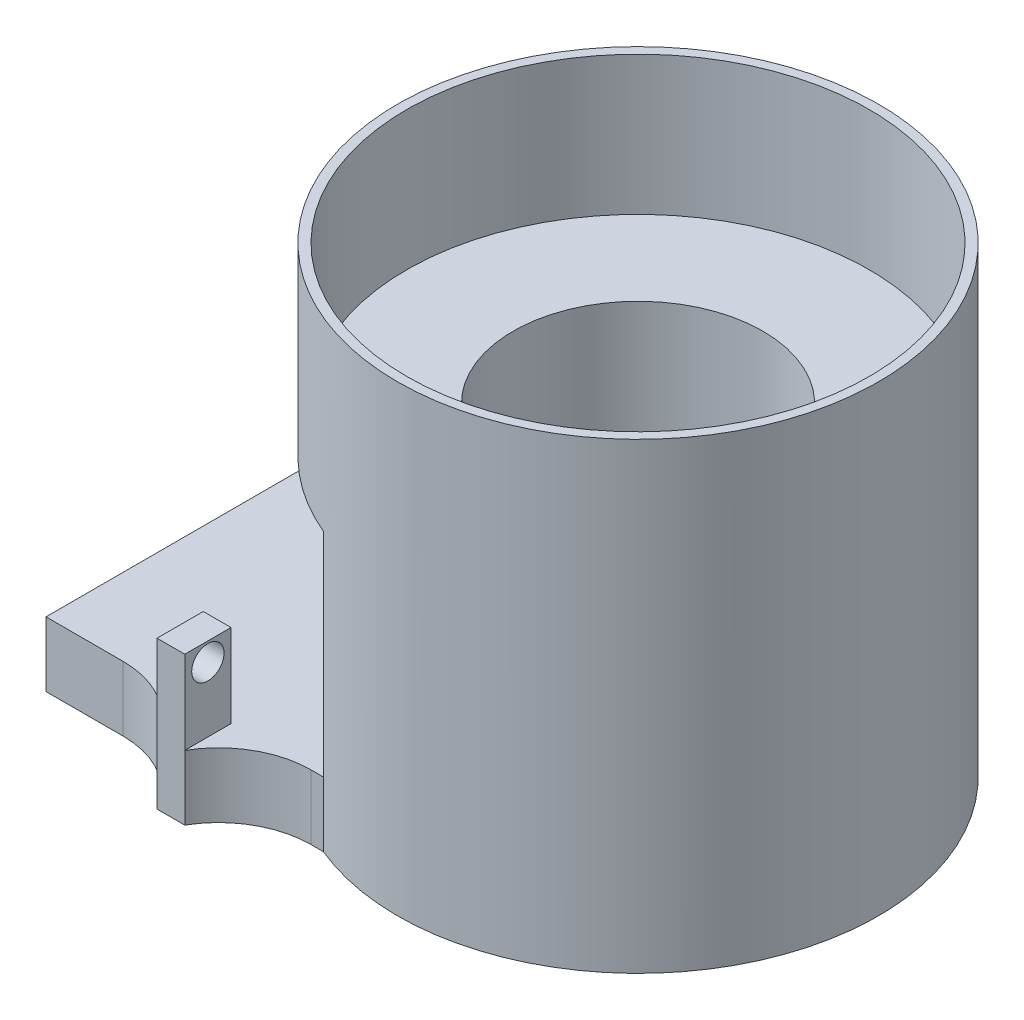
ISO-10303-21;
HEADER;
FILE_DESCRIPTION(('STEP AP214'),'2;1');
FILE_NAME('part.step','',(''),(''),'','','');
FILE_SCHEMA(('AUTOMOTIVE_DESIGN { 1 0 10303 214 1 1 1 1 }'));
ENDSEC;
DATA;
#1=APPLICATION_CONTEXT('core data for automotive mechanical design processes');
#2=APPLICATION_PROTOCOL_DEFINITION('international standard','automotive_design',2000,#1);
#3=PRODUCT_CONTEXT('',#1,'mechanical');
#4=PRODUCT('Part','Part','',(#3));
#5=PRODUCT_RELATED_PRODUCT_CATEGORY('part','',(#4));
#6=PRODUCT_DEFINITION_FORMATION('','',#4);
#7=PRODUCT_DEFINITION_CONTEXT('part definition',#1,'design');
#8=PRODUCT_DEFINITION('design','',#6,#7);
#9=PRODUCT_DEFINITION_SHAPE('','',#8);
#10=(LENGTH_UNIT() NAMED_UNIT(*) SI_UNIT(.MILLI.,.METRE.));
#11=(NAMED_UNIT(*) PLANE_ANGLE_UNIT() SI_UNIT($,.RADIAN.));
#12=(NAMED_UNIT(*) SI_UNIT($,.STERADIAN.) SOLID_ANGLE_UNIT());
#13=UNCERTAINTY_MEASURE_WITH_UNIT(LENGTH_MEASURE(1.E-05),#10,'distance_accuracy_value','');
#14=(GEOMETRIC_REPRESENTATION_CONTEXT(3) GLOBAL_UNCERTAINTY_ASSIGNED_CONTEXT((#13)) GLOBAL_UNIT_ASSIGNED_CONTEXT((#10,
#11,#12)) REPRESENTATION_CONTEXT('',''));
#15=CARTESIAN_POINT('',(0.,0.,0.));
#16=DIRECTION('',(0.,0.,1.));
#17=DIRECTION('',(1.,0.,0.));
#18=AXIS2_PLACEMENT_3D('',#15,#16,#17);
#19=CARTESIAN_POINT('',(0.,2.,0.));
#20=DIRECTION('',(0.,1.,0.));
#21=DIRECTION('',(0.,0.,1.));
#22=AXIS2_PLACEMENT_3D('',#19,#20,#21);
#23=PLANE('',#22);
#24=CARTESIAN_POINT('',(0.,2.,0.));
#25=DIRECTION('',(0.,1.,0.));
#26=DIRECTION('',(0.,0.,1.));
#27=AXIS2_PLACEMENT_3D('',#24,#25,#26);
#28=CIRCLE('',#27,21.5);
#29=CARTESIAN_POINT('',(0.,2.,21.5));
#30=VERTEX_POINT('',#29);
#31=EDGE_CURVE('E545',#30,#30,#28,.T.);
#32=ORIENTED_EDGE('',*,*,#31,.F.);
#33=EDGE_LOOP('',(#32));
#34=FACE_BOUND('',#33,.T.);
#35=CARTESIAN_POINT('',(0.,2.,0.));
#36=DIRECTION('',(0.,1.,0.));
#37=DIRECTION('',(0.,0.,1.));
#38=AXIS2_PLACEMENT_3D('',#35,#36,#37);
#39=CIRCLE('',#38,15.5);
#40=CARTESIAN_POINT('',(0.,2.,15.5));
#41=VERTEX_POINT('',#40);
#42=EDGE_CURVE('E47',#41,#41,#39,.F.);
#43=ORIENTED_EDGE('',*,*,#42,.F.);
#44=EDGE_LOOP('',(#43));
#45=FACE_BOUND('',#44,.T.);
#46=ADVANCED_FACE('F39',(#34,#45),#23,.F.);
#47=CARTESIAN_POINT('',(0.,5.,0.));
#48=DIRECTION('',(0.,-1.,0.));
#49=DIRECTION('',(0.,0.,-1.));
#50=AXIS2_PLACEMENT_3D('',#47,#48,#49);
#51=CYLINDRICAL_SURFACE('',#50,21.5);
#52=CARTESIAN_POINT('',(0.,0.,0.));
#53=DIRECTION('',(0.,1.,0.));
#54=DIRECTION('',(0.,0.,1.));
#55=AXIS2_PLACEMENT_3D('',#52,#53,#54);
#56=CIRCLE('',#55,21.5);
#57=CARTESIAN_POINT('',(-19.0328663106743,0.,-9.99999999999999));
#58=VERTEX_POINT('',#57);
#59=CARTESIAN_POINT('',(-10.,0.,19.0328663106743));
#60=VERTEX_POINT('',#59);
#61=EDGE_CURVE('E320',#58,#60,#56,.T.);
#62=ORIENTED_EDGE('',*,*,#61,.F.);
#63=DIRECTION('',(0.,-1.,0.));
#64=VECTOR('',#63,1.);
#65=CARTESIAN_POINT('',(-19.0328663106743,500000.,-9.99999999999999));
#66=LINE('',#65,#64);
#67=CARTESIAN_POINT('',(-19.0328663106743,-30.,-9.99999999999999));
#68=VERTEX_POINT('',#67);
#69=EDGE_CURVE('E312',#58,#68,#66,.T.);
#70=ORIENTED_EDGE('',*,*,#69,.T.);
#71=CARTESIAN_POINT('',(0.,-30.,0.));
#72=DIRECTION('',(0.,1.,0.));
#73=DIRECTION('',(0.,0.,-1.));
#74=AXIS2_PLACEMENT_3D('',#71,#72,#73);
#75=CIRCLE('',#74,21.5);
#76=CARTESIAN_POINT('',(-10.,-30.,19.0328663106743));
#77=VERTEX_POINT('',#76);
#78=EDGE_CURVE('E295',#77,#68,#75,.T.);
#79=ORIENTED_EDGE('',*,*,#78,.F.);
#80=DIRECTION('',(0.,-1.,0.));
#81=VECTOR('',#80,1.);
#82=CARTESIAN_POINT('',(-10.,5.,19.0328663106743));
#83=LINE('',#82,#81);
#84=CARTESIAN_POINT('',(-10.,-23.,19.0328663106743));
#85=VERTEX_POINT('',#84);
#86=EDGE_CURVE('E283',#85,#77,#83,.T.);
#87=ORIENTED_EDGE('',*,*,#86,.F.);
#88=DIRECTION('',(0.,-1.,0.));
#89=VECTOR('',#88,1.);
#90=CARTESIAN_POINT('',(-10.,500000.,19.0328663106743));
#91=LINE('',#90,#89);
#92=EDGE_CURVE('E309',#60,#85,#91,.T.);
#93=ORIENTED_EDGE('',*,*,#92,.F.);
#94=EDGE_LOOP('',(#62,#70,#79,#87,#93));
#95=FACE_BOUND('',#94,.T.);
#96=ORIENTED_EDGE('',*,*,#31,.T.);
#97=EDGE_LOOP('',(#96));
#98=FACE_BOUND('',#97,.T.);
#99=ADVANCED_FACE('F335',(#95,#98),#51,.F.);
#100=CARTESIAN_POINT('',(0.,0.,0.));
#101=DIRECTION('',(0.,1.,0.));
#102=DIRECTION('',(0.,0.,1.));
#103=AXIS2_PLACEMENT_3D('',#100,#101,#102);
#104=PLANE('',#103);
#105=CARTESIAN_POINT('',(0.,0.,0.));
#106=DIRECTION('',(0.,1.,0.));
#107=DIRECTION('',(0.,0.,1.));
#108=AXIS2_PLACEMENT_3D('',#105,#106,#107);
#109=CIRCLE('',#108,26.);
#110=CARTESIAN_POINT('',(-24.,0.,-9.99999999999999));
#111=VERTEX_POINT('',#110);
#112=CARTESIAN_POINT('',(-10.,0.,24.));
#113=VERTEX_POINT('',#112);
#114=EDGE_CURVE('E322',#111,#113,#109,.T.);
#115=ORIENTED_EDGE('',*,*,#114,.F.);
#116=DIRECTION('',(-1.,0.,0.));
#117=VECTOR('',#116,1.);
#118=CARTESIAN_POINT('',(-20.,0.,-9.99999999999999));
#119=LINE('',#118,#117);
#120=EDGE_CURVE('E289',#58,#111,#119,.T.);
#121=ORIENTED_EDGE('',*,*,#120,.F.);
#122=ORIENTED_EDGE('',*,*,#61,.T.);
#123=DIRECTION('',(0.,0.,-1.));
#124=VECTOR('',#123,1.);
#125=CARTESIAN_POINT('',(-10.,0.,19.0328663106743));
#126=LINE('',#125,#124);
#127=EDGE_CURVE('E286',#113,#60,#126,.T.);
#128=ORIENTED_EDGE('',*,*,#127,.F.);
#129=EDGE_LOOP('',(#115,#121,#122,#128));
#130=FACE_BOUND('',#129,.T.);
#131=ADVANCED_FACE('F341',(#130),#104,.F.);
#132=CARTESIAN_POINT('',(0.,5.,0.));
#133=DIRECTION('',(0.,1.,0.));
#134=DIRECTION('',(0.,0.,1.));
#135=AXIS2_PLACEMENT_3D('',#132,#133,#134);
#136=PLANE('',#135);
#137=CARTESIAN_POINT('',(0.,5.,0.));
#138=DIRECTION('',(0.,1.,0.));
#139=DIRECTION('',(0.,0.,1.));
#140=AXIS2_PLACEMENT_3D('',#137,#138,#139);
#141=CIRCLE('',#140,25.);
#142=CARTESIAN_POINT('',(0.,5.,25.));
#143=VERTEX_POINT('',#142);
#144=EDGE_CURVE('E324',#143,#143,#141,.F.);
#145=ORIENTED_EDGE('',*,*,#144,.F.);
#146=EDGE_LOOP('',(#145));
#147=FACE_BOUND('',#146,.T.);
#148=CARTESIAN_POINT('',(0.,5.,0.));
#149=DIRECTION('',(0.,1.,0.));
#150=DIRECTION('',(0.,0.,1.));
#151=AXIS2_PLACEMENT_3D('',#148,#149,#150);
#152=CIRCLE('',#151,13.5);
#153=CARTESIAN_POINT('',(0.,5.,13.5));
#154=VERTEX_POINT('',#153);
#155=EDGE_CURVE('E548',#154,#154,#152,.T.);
#156=ORIENTED_EDGE('',*,*,#155,.F.);
#157=EDGE_LOOP('',(#156));
#158=FACE_BOUND('',#157,.T.);
#159=ADVANCED_FACE('F439',(#147,#158),#136,.T.);
#160=CARTESIAN_POINT('',(0.,5.,0.));
#161=DIRECTION('',(0.,-1.,0.));
#162=DIRECTION('',(0.,0.,-1.));
#163=AXIS2_PLACEMENT_3D('',#160,#161,#162);
#164=CYLINDRICAL_SURFACE('',#163,26.);
#165=ORIENTED_EDGE('',*,*,#114,.T.);
#166=DIRECTION('',(0.,-1.,0.));
#167=VECTOR('',#166,1.);
#168=CARTESIAN_POINT('',(-10.,500000.,24.));
#169=LINE('',#168,#167);
#170=CARTESIAN_POINT('',(-10.,-23.,24.));
#171=VERTEX_POINT('',#170);
#172=EDGE_CURVE('E291',#113,#171,#169,.T.);
#173=ORIENTED_EDGE('',*,*,#172,.T.);
#174=DIRECTION('',(0.,-1.,0.));
#175=VECTOR('',#174,1.);
#176=CARTESIAN_POINT('',(-10.,-23.,24.));
#177=LINE('',#176,#175);
#178=CARTESIAN_POINT('',(-10.,-30.,24.));
#179=VERTEX_POINT('',#178);
#180=EDGE_CURVE('E221',#171,#179,#177,.T.);
#181=ORIENTED_EDGE('',*,*,#180,.T.);
#182=CARTESIAN_POINT('',(0.,-30.,0.));
#183=DIRECTION('',(0.,-1.,0.));
#184=DIRECTION('',(0.,0.,-1.));
#185=AXIS2_PLACEMENT_3D('',#182,#183,#184);
#186=CIRCLE('',#185,26.);
#187=CARTESIAN_POINT('',(-24.,-30.,-9.99999999999999));
#188=VERTEX_POINT('',#187);
#189=EDGE_CURVE('E300',#188,#179,#186,.T.);
#190=ORIENTED_EDGE('',*,*,#189,.F.);
#191=DIRECTION('',(0.,-1.,0.));
#192=VECTOR('',#191,1.);
#193=CARTESIAN_POINT('',(-24.,500000.,-9.99999999999999));
#194=LINE('',#193,#192);
#195=EDGE_CURVE('E303',#111,#188,#194,.T.);
#196=ORIENTED_EDGE('',*,*,#195,.F.);
#197=EDGE_LOOP('',(#165,#173,#181,#190,#196));
#198=FACE_BOUND('',#197,.T.);
#199=CARTESIAN_POINT('',(0.,20.,0.));
#200=DIRECTION('',(0.,1.,0.));
#201=DIRECTION('',(0.,0.,1.));
#202=AXIS2_PLACEMENT_3D('',#199,#200,#201);
#203=CIRCLE('',#202,26.);
#204=CARTESIAN_POINT('',(0.,20.,26.));
#205=VERTEX_POINT('',#204);
#206=EDGE_CURVE('E317',#205,#205,#203,.T.);
#207=ORIENTED_EDGE('',*,*,#206,.F.);
#208=EDGE_LOOP('',(#207));
#209=FACE_BOUND('',#208,.T.);
#210=ADVANCED_FACE('F41',(#198,#209),#164,.T.);
#211=CARTESIAN_POINT('',(0.,20.,0.));
#212=DIRECTION('',(0.,1.,0.));
#213=DIRECTION('',(0.,0.,1.));
#214=AXIS2_PLACEMENT_3D('',#211,#212,#213);
#215=PLANE('',#214);
#216=ORIENTED_EDGE('',*,*,#206,.T.);
#217=EDGE_LOOP('',(#216));
#218=FACE_BOUND('',#217,.T.);
#219=CARTESIAN_POINT('',(0.,20.,0.));
#220=DIRECTION('',(0.,1.,0.));
#221=DIRECTION('',(0.,0.,1.));
#222=AXIS2_PLACEMENT_3D('',#219,#220,#221);
#223=CIRCLE('',#222,25.);
#224=CARTESIAN_POINT('',(0.,20.,25.));
#225=VERTEX_POINT('',#224);
#226=EDGE_CURVE('E306',#225,#225,#223,.T.);
#227=ORIENTED_EDGE('',*,*,#226,.F.);
#228=EDGE_LOOP('',(#227));
#229=FACE_BOUND('',#228,.T.);
#230=ADVANCED_FACE('F434',(#218,#229),#215,.T.);
#231=CARTESIAN_POINT('',(0.,20.,0.));
#232=DIRECTION('',(0.,-1.,0.));
#233=DIRECTION('',(0.,0.,-1.));
#234=AXIS2_PLACEMENT_3D('',#231,#232,#233);
#235=CYLINDRICAL_SURFACE('',#234,25.);
#236=ORIENTED_EDGE('',*,*,#226,.T.);
#237=EDGE_LOOP('',(#236));
#238=FACE_BOUND('',#237,.T.);
#239=ORIENTED_EDGE('',*,*,#144,.T.);
#240=EDGE_LOOP('',(#239));
#241=FACE_BOUND('',#240,.T.);
#242=ADVANCED_FACE('F426',(#238,#241),#235,.F.);
#243=CARTESIAN_POINT('',(-10.,500000.,19.0328663106743));
#244=DIRECTION('',(-1.,0.,0.));
#245=DIRECTION('',(0.,0.,1.));
#246=AXIS2_PLACEMENT_3D('',#243,#244,#245);
#247=PLANE('',#246);
#248=DIRECTION('',(0.,0.,1.));
#249=VECTOR('',#248,1.);
#250=CARTESIAN_POINT('',(-10.,-23.,0.));
#251=LINE('',#250,#249);
#252=EDGE_CURVE('E480',#85,#171,#251,.T.);
#253=ORIENTED_EDGE('',*,*,#252,.T.);
#254=ORIENTED_EDGE('',*,*,#172,.F.);
#255=ORIENTED_EDGE('',*,*,#127,.T.);
#256=ORIENTED_EDGE('',*,*,#92,.T.);
#257=EDGE_LOOP('',(#253,#254,#255,#256));
#258=FACE_BOUND('',#257,.T.);
#259=ADVANCED_FACE('F372',(#258),#247,.T.);
#260=CARTESIAN_POINT('',(-20.,500000.,-9.99999999999999));
#261=DIRECTION('',(0.,0.,1.));
#262=DIRECTION('',(1.,0.,0.));
#263=AXIS2_PLACEMENT_3D('',#260,#261,#262);
#264=PLANE('',#263);
#265=DIRECTION('',(-1.,0.,0.));
#266=VECTOR('',#265,1.);
#267=CARTESIAN_POINT('',(-20.,-30.,-9.99999999999999));
#268=LINE('',#267,#266);
#269=CARTESIAN_POINT('',(-20.,-30.,-9.99999999999999));
#270=VERTEX_POINT('',#269);
#271=EDGE_CURVE('E292',#68,#270,#268,.T.);
#272=ORIENTED_EDGE('',*,*,#271,.F.);
#273=ORIENTED_EDGE('',*,*,#69,.F.);
#274=ORIENTED_EDGE('',*,*,#120,.T.);
#275=ORIENTED_EDGE('',*,*,#195,.T.);
#276=DIRECTION('',(-1.,0.,0.));
#277=VECTOR('',#276,1.);
#278=CARTESIAN_POINT('',(-24.,-30.,-9.99999999999999));
#279=LINE('',#278,#277);
#280=CARTESIAN_POINT('',(-23.,-30.,-9.99999999999999));
#281=VERTEX_POINT('',#280);
#282=EDGE_CURVE('E296',#281,#188,#279,.T.);
#283=ORIENTED_EDGE('',*,*,#282,.F.);
#284=DIRECTION('',(0.,-1.,0.));
#285=VECTOR('',#284,1.);
#286=CARTESIAN_POINT('',(-23.,-23.,-9.99999999999999));
#287=LINE('',#286,#285);
#288=CARTESIAN_POINT('',(-23.,-23.0000000000246,-9.99999999999999));
#289=VERTEX_POINT('',#288);
#290=EDGE_CURVE('E208',#289,#281,#287,.T.);
#291=ORIENTED_EDGE('',*,*,#290,.F.);
#292=CARTESIAN_POINT('',(-23.,-14.,-9.99999999999999));
#293=VERTEX_POINT('',#292);
#294=EDGE_CURVE('E200',#293,#289,#287,.T.);
#295=ORIENTED_EDGE('',*,*,#294,.F.);
#296=DIRECTION('',(-1.,0.,0.));
#297=VECTOR('',#296,1.);
#298=CARTESIAN_POINT('',(-16.,-14.,-9.99999999999999));
#299=LINE('',#298,#297);
#300=CARTESIAN_POINT('',(-20.,-14.,-9.99999999999999));
#301=VERTEX_POINT('',#300);
#302=EDGE_CURVE('E187',#301,#293,#299,.T.);
#303=ORIENTED_EDGE('',*,*,#302,.F.);
#304=DIRECTION('',(0.,-1.,0.));
#305=VECTOR('',#304,1.);
#306=CARTESIAN_POINT('',(-20.,-23.,-9.99999999999999));
#307=LINE('',#306,#305);
#308=CARTESIAN_POINT('',(-20.,-23.0000000000246,-9.99999999999999));
#309=VERTEX_POINT('',#308);
#310=EDGE_CURVE('E62',#301,#309,#307,.T.);
#311=ORIENTED_EDGE('',*,*,#310,.T.);
#312=EDGE_CURVE('E210',#309,#270,#307,.T.);
#313=ORIENTED_EDGE('',*,*,#312,.T.);
#314=EDGE_LOOP('',(#272,#273,#274,#275,#283,#291,#295,#303,#311,#313));
#315=FACE_BOUND('',#314,.T.);
#316=ADVANCED_FACE('F206',(#315),#264,.T.);
#317=CARTESIAN_POINT('',(0.,-30.,0.));
#318=DIRECTION('',(0.,-1.,0.));
#319=DIRECTION('',(0.,0.,-1.));
#320=AXIS2_PLACEMENT_3D('',#317,#318,#319);
#321=PLANE('',#320);
#322=DIRECTION('',(0.,0.,1.));
#323=VECTOR('',#322,1.);
#324=CARTESIAN_POINT('',(-10.,-30.,0.));
#325=LINE('',#324,#323);
#326=CARTESIAN_POINT('',(-10.,-30.,-5.));
#327=VERTEX_POINT('',#326);
#328=EDGE_CURVE('E215',#327,#77,#325,.T.);
#329=ORIENTED_EDGE('',*,*,#328,.T.);
#330=ORIENTED_EDGE('',*,*,#78,.T.);
#331=ORIENTED_EDGE('',*,*,#271,.T.);
#332=CARTESIAN_POINT('',(-11.3397459621556,-30.,-15.));
#333=DIRECTION('',(0.,1.,0.));
#334=DIRECTION('',(0.,0.,1.));
#335=AXIS2_PLACEMENT_3D('',#332,#333,#334);
#336=CIRCLE('',#335,10.);
#337=CARTESIAN_POINT('',(-11.3397459621556,-30.,-5.));
#338=VERTEX_POINT('',#337);
#339=EDGE_CURVE('E274',#270,#338,#336,.T.);
#340=ORIENTED_EDGE('',*,*,#339,.T.);
#341=DIRECTION('',(1.,0.,0.));
#342=VECTOR('',#341,1.);
#343=CARTESIAN_POINT('',(0.,-30.,-5.));
#344=LINE('',#343,#342);
#345=EDGE_CURVE('E471',#338,#327,#344,.T.);
#346=ORIENTED_EDGE('',*,*,#345,.T.);
#347=EDGE_LOOP('',(#329,#330,#331,#340,#346));
#348=FACE_BOUND('',#347,.T.);
#349=ORIENTED_EDGE('',*,*,#189,.T.);
#350=DIRECTION('',(1.,0.,0.));
#351=VECTOR('',#350,1.);
#352=CARTESIAN_POINT('',(0.,-30.,24.));
#353=LINE('',#352,#351);
#354=CARTESIAN_POINT('',(-11.3397459621556,-30.,24.));
#355=VERTEX_POINT('',#354);
#356=EDGE_CURVE('E494',#355,#179,#353,.T.);
#357=ORIENTED_EDGE('',*,*,#356,.F.);
#358=CARTESIAN_POINT('',(-11.3397459621556,-30.,34.));
#359=DIRECTION('',(0.,1.,0.));
#360=DIRECTION('',(0.,0.,1.));
#361=AXIS2_PLACEMENT_3D('',#358,#359,#360);
#362=CIRCLE('',#361,10.);
#363=CARTESIAN_POINT('',(-20.,-30.,29.));
#364=VERTEX_POINT('',#363);
#365=EDGE_CURVE('E265',#355,#364,#362,.T.);
#366=ORIENTED_EDGE('',*,*,#365,.T.);
#367=DIRECTION('',(-1.,0.,0.));
#368=VECTOR('',#367,1.);
#369=CARTESIAN_POINT('',(0.,-30.,29.));
#370=LINE('',#369,#368);
#371=CARTESIAN_POINT('',(-23.,-30.,29.));
#372=VERTEX_POINT('',#371);
#373=EDGE_CURVE('E493',#364,#372,#370,.T.);
#374=ORIENTED_EDGE('',*,*,#373,.T.);
#375=CARTESIAN_POINT('',(-31.6602540378444,-30.,34.));
#376=DIRECTION('',(0.,1.,0.));
#377=DIRECTION('',(0.,0.,1.));
#378=AXIS2_PLACEMENT_3D('',#375,#376,#377);
#379=CIRCLE('',#378,10.);
#380=CARTESIAN_POINT('',(-31.6602540378444,-30.,24.));
#381=VERTEX_POINT('',#380);
#382=EDGE_CURVE('E269',#372,#381,#379,.T.);
#383=ORIENTED_EDGE('',*,*,#382,.T.);
#384=CARTESIAN_POINT('',(-40.,-30.,24.));
#385=VERTEX_POINT('',#384);
#386=EDGE_CURVE('E491',#385,#381,#353,.T.);
#387=ORIENTED_EDGE('',*,*,#386,.F.);
#388=DIRECTION('',(0.,0.,1.));
#389=VECTOR('',#388,1.);
#390=CARTESIAN_POINT('',(-40.,-30.,0.));
#391=LINE('',#390,#389);
#392=CARTESIAN_POINT('',(-40.,-30.,-5.));
#393=VERTEX_POINT('',#392);
#394=EDGE_CURVE('E488',#393,#385,#391,.T.);
#395=ORIENTED_EDGE('',*,*,#394,.F.);
#396=CARTESIAN_POINT('',(-31.6602540378444,-30.,-5.));
#397=VERTEX_POINT('',#396);
#398=EDGE_CURVE('E460',#393,#397,#344,.T.);
#399=ORIENTED_EDGE('',*,*,#398,.T.);
#400=CARTESIAN_POINT('',(-31.6602540378444,-30.,-15.));
#401=DIRECTION('',(0.,1.,0.));
#402=DIRECTION('',(0.,0.,1.));
#403=AXIS2_PLACEMENT_3D('',#400,#401,#402);
#404=CIRCLE('',#403,10.);
#405=EDGE_CURVE('E278',#397,#281,#404,.T.);
#406=ORIENTED_EDGE('',*,*,#405,.T.);
#407=ORIENTED_EDGE('',*,*,#282,.T.);
#408=EDGE_LOOP('',(#349,#357,#366,#374,#383,#387,#395,#399,#406,#407));
#409=FACE_BOUND('',#408,.T.);
#410=ADVANCED_FACE('F370',(#348,#409),#321,.T.);
#411=CARTESIAN_POINT('',(0.,-23.,0.));
#412=DIRECTION('',(0.,1.,0.));
#413=DIRECTION('',(0.,0.,1.));
#414=AXIS2_PLACEMENT_3D('',#411,#412,#413);
#415=PLANE('',#414);
#416=DIRECTION('',(1.,0.,0.));
#417=VECTOR('',#416,1.);
#418=CARTESIAN_POINT('',(0.,-23.,-5.));
#419=LINE('',#418,#417);
#420=CARTESIAN_POINT('',(-11.3397459621556,-23.,-5.));
#421=VERTEX_POINT('',#420);
#422=CARTESIAN_POINT('',(-10.,-23.,-5.));
#423=VERTEX_POINT('',#422);
#424=EDGE_CURVE('E213',#421,#423,#419,.T.);
#425=ORIENTED_EDGE('',*,*,#424,.F.);
#426=CARTESIAN_POINT('',(-11.3397459621556,-23.,-15.));
#427=DIRECTION('',(0.,1.,0.));
#428=DIRECTION('',(0.,0.,1.));
#429=AXIS2_PLACEMENT_3D('',#426,#427,#428);
#430=CIRCLE('',#429,10.);
#431=EDGE_CURVE('E276',#421,#309,#430,.F.);
#432=ORIENTED_EDGE('',*,*,#431,.T.);
#433=DIRECTION('',(0.,0.,-1.));
#434=VECTOR('',#433,1.);
#435=CARTESIAN_POINT('',(-20.,-23.,0.));
#436=LINE('',#435,#434);
#437=CARTESIAN_POINT('',(-20.,-23.,-5.));
#438=VERTEX_POINT('',#437);
#439=EDGE_CURVE('E255',#438,#309,#436,.T.);
#440=ORIENTED_EDGE('',*,*,#439,.F.);
#441=DIRECTION('',(1.,0.,0.));
#442=VECTOR('',#441,1.);
#443=CARTESIAN_POINT('',(-20.,-23.,-5.));
#444=LINE('',#443,#442);
#445=CARTESIAN_POINT('',(-23.,-23.,-5.));
#446=VERTEX_POINT('',#445);
#447=EDGE_CURVE('E239',#446,#438,#444,.T.);
#448=ORIENTED_EDGE('',*,*,#447,.F.);
#449=DIRECTION('',(0.,0.,1.));
#450=VECTOR('',#449,1.);
#451=CARTESIAN_POINT('',(-23.,-23.,0.));
#452=LINE('',#451,#450);
#453=EDGE_CURVE('E263',#289,#446,#452,.T.);
#454=ORIENTED_EDGE('',*,*,#453,.F.);
#455=CARTESIAN_POINT('',(-31.6602540378444,-23.,-15.));
#456=DIRECTION('',(0.,1.,0.));
#457=DIRECTION('',(0.,0.,1.));
#458=AXIS2_PLACEMENT_3D('',#455,#456,#457);
#459=CIRCLE('',#458,10.);
#460=CARTESIAN_POINT('',(-31.6602540378444,-23.,-5.));
#461=VERTEX_POINT('',#460);
#462=EDGE_CURVE('E281',#289,#461,#459,.F.);
#463=ORIENTED_EDGE('',*,*,#462,.T.);
#464=CARTESIAN_POINT('',(-40.,-23.,-5.));
#465=VERTEX_POINT('',#464);
#466=EDGE_CURVE('E466',#465,#461,#419,.T.);
#467=ORIENTED_EDGE('',*,*,#466,.F.);
#468=DIRECTION('',(0.,0.,1.));
#469=VECTOR('',#468,1.);
#470=CARTESIAN_POINT('',(-40.,-23.,0.));
#471=LINE('',#470,#469);
#472=CARTESIAN_POINT('',(-40.,-23.,24.));
#473=VERTEX_POINT('',#472);
#474=EDGE_CURVE('E470',#465,#473,#471,.T.);
#475=ORIENTED_EDGE('',*,*,#474,.T.);
#476=DIRECTION('',(1.,0.,0.));
#477=VECTOR('',#476,1.);
#478=CARTESIAN_POINT('',(0.,-23.,24.));
#479=LINE('',#478,#477);
#480=CARTESIAN_POINT('',(-31.6602540378444,-23.,24.));
#481=VERTEX_POINT('',#480);
#482=EDGE_CURVE('E473',#473,#481,#479,.T.);
#483=ORIENTED_EDGE('',*,*,#482,.T.);
#484=CARTESIAN_POINT('',(-31.6602540378444,-23.,34.));
#485=DIRECTION('',(0.,1.,0.));
#486=DIRECTION('',(0.,0.,1.));
#487=AXIS2_PLACEMENT_3D('',#484,#485,#486);
#488=CIRCLE('',#487,10.);
#489=CARTESIAN_POINT('',(-23.,-23.,29.));
#490=VERTEX_POINT('',#489);
#491=EDGE_CURVE('E271',#481,#490,#488,.F.);
#492=ORIENTED_EDGE('',*,*,#491,.T.);
#493=DIRECTION('',(0.,0.,1.));
#494=VECTOR('',#493,1.);
#495=CARTESIAN_POINT('',(-23.,-23.,0.));
#496=LINE('',#495,#494);
#497=CARTESIAN_POINT('',(-23.,-23.,24.));
#498=VERTEX_POINT('',#497);
#499=EDGE_CURVE('E250',#498,#490,#496,.T.);
#500=ORIENTED_EDGE('',*,*,#499,.F.);
#501=DIRECTION('',(-1.,0.,0.));
#502=VECTOR('',#501,1.);
#503=CARTESIAN_POINT('',(-20.,-23.,24.));
#504=LINE('',#503,#502);
#505=CARTESIAN_POINT('',(-20.,-23.,24.));
#506=VERTEX_POINT('',#505);
#507=EDGE_CURVE('E532',#506,#498,#504,.T.);
#508=ORIENTED_EDGE('',*,*,#507,.F.);
#509=DIRECTION('',(0.,0.,-1.));
#510=VECTOR('',#509,1.);
#511=CARTESIAN_POINT('',(-20.,-23.,0.));
#512=LINE('',#511,#510);
#513=CARTESIAN_POINT('',(-20.,-23.,29.));
#514=VERTEX_POINT('',#513);
#515=EDGE_CURVE('E247',#514,#506,#512,.T.);
#516=ORIENTED_EDGE('',*,*,#515,.F.);
#517=CARTESIAN_POINT('',(-11.3397459621556,-23.,34.));
#518=DIRECTION('',(0.,1.,0.));
#519=DIRECTION('',(0.,0.,1.));
#520=AXIS2_PLACEMENT_3D('',#517,#518,#519);
#521=CIRCLE('',#520,10.);
#522=CARTESIAN_POINT('',(-11.3397459621556,-23.,24.));
#523=VERTEX_POINT('',#522);
#524=EDGE_CURVE('E267',#514,#523,#521,.F.);
#525=ORIENTED_EDGE('',*,*,#524,.T.);
#526=EDGE_CURVE('E485',#523,#171,#479,.T.);
#527=ORIENTED_EDGE('',*,*,#526,.T.);
#528=ORIENTED_EDGE('',*,*,#252,.F.);
#529=EDGE_CURVE('E477',#423,#85,#251,.T.);
#530=ORIENTED_EDGE('',*,*,#529,.F.);
#531=EDGE_LOOP('',(#425,#432,#440,#448,#454,#463,#467,#475,#483,#492,#500,#508,#516,#525,#527,
#528,#530));
#532=FACE_BOUND('',#531,.T.);
#533=ADVANCED_FACE('F367',(#532),#415,.T.);
#534=CARTESIAN_POINT('',(-23.,-23.,0.));
#535=DIRECTION('',(-1.,0.,0.));
#536=DIRECTION('',(0.,0.,1.));
#537=AXIS2_PLACEMENT_3D('',#534,#535,#536);
#538=PLANE('',#537);
#539=DIRECTION('',(0.,0.,1.));
#540=VECTOR('',#539,1.);
#541=CARTESIAN_POINT('',(-23.,-14.,-9.99999999999999));
#542=LINE('',#541,#540);
#543=CARTESIAN_POINT('',(-23.,-14.,-5.));
#544=VERTEX_POINT('',#543);
#545=EDGE_CURVE('E190',#293,#544,#542,.T.);
#546=ORIENTED_EDGE('',*,*,#545,.F.);
#547=ORIENTED_EDGE('',*,*,#294,.T.);
#548=ORIENTED_EDGE('',*,*,#453,.T.);
#549=DIRECTION('',(0.,-1.,0.));
#550=VECTOR('',#549,1.);
#551=CARTESIAN_POINT('',(-23.,-9.,-5.));
#552=LINE('',#551,#550);
#553=EDGE_CURVE('E202',#544,#446,#552,.T.);
#554=ORIENTED_EDGE('',*,*,#553,.F.);
#555=EDGE_LOOP('',(#546,#547,#548,#554));
#556=FACE_BOUND('',#555,.T.);
#557=CARTESIAN_POINT('',(-23.,-16.,-7.49999999999999));
#558=DIRECTION('',(-1.,0.,0.));
#559=DIRECTION('',(0.,0.,1.));
#560=AXIS2_PLACEMENT_3D('',#557,#558,#559);
#561=CIRCLE('',#560,1.75);
#562=CARTESIAN_POINT('',(-23.,-16.,-5.74999999999999));
#563=VERTEX_POINT('',#562);
#564=EDGE_CURVE('E240',#563,#563,#561,.T.);
#565=ORIENTED_EDGE('',*,*,#564,.F.);
#566=EDGE_LOOP('',(#565));
#567=FACE_BOUND('',#566,.T.);
#568=ADVANCED_FACE('F197',(#556,#567),#538,.T.);
#569=CARTESIAN_POINT('',(0.,-23.,-5.));
#570=DIRECTION('',(0.,0.,-1.));
#571=DIRECTION('',(-1.,0.,0.));
#572=AXIS2_PLACEMENT_3D('',#569,#570,#571);
#573=PLANE('',#572);
#574=ORIENTED_EDGE('',*,*,#466,.T.);
#575=DIRECTION('',(0.,-1.,0.));
#576=VECTOR('',#575,1.);
#577=CARTESIAN_POINT('',(-31.6602540378444,-30.,-5.));
#578=LINE('',#577,#576);
#579=EDGE_CURVE('E260',#461,#397,#578,.T.);
#580=ORIENTED_EDGE('',*,*,#579,.T.);
#581=ORIENTED_EDGE('',*,*,#398,.F.);
#582=DIRECTION('',(0.,-1.,0.));
#583=VECTOR('',#582,1.);
#584=CARTESIAN_POINT('',(-40.,-23.,-5.));
#585=LINE('',#584,#583);
#586=EDGE_CURVE('E233',#465,#393,#585,.T.);
#587=ORIENTED_EDGE('',*,*,#586,.F.);
#588=EDGE_LOOP('',(#574,#580,#581,#587));
#589=FACE_BOUND('',#588,.T.);
#590=ADVANCED_FACE('F381',(#589),#573,.T.);
#591=CARTESIAN_POINT('',(-40.,-23.,0.));
#592=DIRECTION('',(1.,0.,0.));
#593=DIRECTION('',(0.,0.,-1.));
#594=AXIS2_PLACEMENT_3D('',#591,#592,#593);
#595=PLANE('',#594);
#596=ORIENTED_EDGE('',*,*,#394,.T.);
#597=DIRECTION('',(0.,-1.,0.));
#598=VECTOR('',#597,1.);
#599=CARTESIAN_POINT('',(-40.,-23.,24.));
#600=LINE('',#599,#598);
#601=EDGE_CURVE('E230',#473,#385,#600,.T.);
#602=ORIENTED_EDGE('',*,*,#601,.F.);
#603=ORIENTED_EDGE('',*,*,#474,.F.);
#604=ORIENTED_EDGE('',*,*,#586,.T.);
#605=EDGE_LOOP('',(#596,#602,#603,#604));
#606=FACE_BOUND('',#605,.T.);
#607=ADVANCED_FACE('F402',(#606),#595,.F.);
#608=CARTESIAN_POINT('',(0.,-23.,24.));
#609=DIRECTION('',(0.,0.,-1.));
#610=DIRECTION('',(-1.,0.,0.));
#611=AXIS2_PLACEMENT_3D('',#608,#609,#610);
#612=PLANE('',#611);
#613=ORIENTED_EDGE('',*,*,#386,.T.);
#614=DIRECTION('',(0.,-1.,0.));
#615=VECTOR('',#614,1.);
#616=CARTESIAN_POINT('',(-31.6602540378444,-23.,24.));
#617=LINE('',#616,#615);
#618=EDGE_CURVE('E253',#381,#481,#617,.F.);
#619=ORIENTED_EDGE('',*,*,#618,.T.);
#620=ORIENTED_EDGE('',*,*,#482,.F.);
#621=ORIENTED_EDGE('',*,*,#601,.T.);
#622=EDGE_LOOP('',(#613,#619,#620,#621));
#623=FACE_BOUND('',#622,.T.);
#624=ADVANCED_FACE('F390',(#623),#612,.F.);
#625=CARTESIAN_POINT('',(-23.,-23.,0.));
#626=DIRECTION('',(1.,0.,0.));
#627=DIRECTION('',(0.,0.,-1.));
#628=AXIS2_PLACEMENT_3D('',#625,#626,#627);
#629=PLANE('',#628);
#630=CARTESIAN_POINT('',(-23.,-16.,26.5));
#631=DIRECTION('',(-1.,0.,0.));
#632=DIRECTION('',(0.,0.,1.));
#633=AXIS2_PLACEMENT_3D('',#630,#631,#632);
#634=CIRCLE('',#633,1.75);
#635=CARTESIAN_POINT('',(-23.,-16.,28.25));
#636=VERTEX_POINT('',#635);
#637=EDGE_CURVE('E244',#636,#636,#634,.T.);
#638=ORIENTED_EDGE('',*,*,#637,.F.);
#639=EDGE_LOOP('',(#638));
#640=FACE_BOUND('',#639,.T.);
#641=DIRECTION('',(0.,-1.,0.));
#642=VECTOR('',#641,1.);
#643=CARTESIAN_POINT('',(-23.,-23.,29.));
#644=LINE('',#643,#642);
#645=CARTESIAN_POINT('',(-23.,-14.,29.));
#646=VERTEX_POINT('',#645);
#647=EDGE_CURVE('E228',#646,#490,#644,.T.);
#648=ORIENTED_EDGE('',*,*,#647,.F.);
#649=CARTESIAN_POINT('',(-23.,-14.,24.));
#650=VERTEX_POINT('',#649);
#651=EDGE_CURVE('E203',#650,#646,#542,.T.);
#652=ORIENTED_EDGE('',*,*,#651,.F.);
#653=DIRECTION('',(0.,-1.,0.));
#654=VECTOR('',#653,1.);
#655=CARTESIAN_POINT('',(-23.,-9.,24.));
#656=LINE('',#655,#654);
#657=EDGE_CURVE('E531',#650,#498,#656,.T.);
#658=ORIENTED_EDGE('',*,*,#657,.T.);
#659=ORIENTED_EDGE('',*,*,#499,.T.);
#660=EDGE_LOOP('',(#648,#652,#658,#659));
#661=FACE_BOUND('',#660,.T.);
#662=ADVANCED_FACE('F397',(#640,#661),#629,.F.);
#663=CARTESIAN_POINT('',(0.,-23.,29.));
#664=DIRECTION('',(0.,0.,1.));
#665=DIRECTION('',(1.,0.,0.));
#666=AXIS2_PLACEMENT_3D('',#663,#664,#665);
#667=PLANE('',#666);
#668=DIRECTION('',(1.,0.,0.));
#669=VECTOR('',#668,1.);
#670=CARTESIAN_POINT('',(0.,-14.,29.));
#671=LINE('',#670,#669);
#672=CARTESIAN_POINT('',(-20.,-14.,29.));
#673=VERTEX_POINT('',#672);
#674=EDGE_CURVE('E558',#646,#673,#671,.T.);
#675=ORIENTED_EDGE('',*,*,#674,.F.);
#676=ORIENTED_EDGE('',*,*,#647,.T.);
#677=EDGE_CURVE('E227',#490,#372,#644,.T.);
#678=ORIENTED_EDGE('',*,*,#677,.T.);
#679=ORIENTED_EDGE('',*,*,#373,.F.);
#680=DIRECTION('',(0.,-1.,0.));
#681=VECTOR('',#680,1.);
#682=CARTESIAN_POINT('',(-20.,-23.,29.));
#683=LINE('',#682,#681);
#684=EDGE_CURVE('E224',#514,#364,#683,.T.);
#685=ORIENTED_EDGE('',*,*,#684,.F.);
#686=EDGE_CURVE('E225',#673,#514,#683,.T.);
#687=ORIENTED_EDGE('',*,*,#686,.F.);
#688=EDGE_LOOP('',(#675,#676,#678,#679,#685,#687));
#689=FACE_BOUND('',#688,.T.);
#690=ADVANCED_FACE('F393',(#689),#667,.T.);
#691=CARTESIAN_POINT('',(-20.,-23.,0.));
#692=DIRECTION('',(1.,0.,0.));
#693=DIRECTION('',(0.,0.,-1.));
#694=AXIS2_PLACEMENT_3D('',#691,#692,#693);
#695=PLANE('',#694);
#696=DIRECTION('',(0.,0.,-1.));
#697=VECTOR('',#696,1.);
#698=CARTESIAN_POINT('',(-20.,-14.,0.));
#699=LINE('',#698,#697);
#700=CARTESIAN_POINT('',(-20.,-14.,24.));
#701=VERTEX_POINT('',#700);
#702=EDGE_CURVE('E54',#673,#701,#699,.T.);
#703=ORIENTED_EDGE('',*,*,#702,.F.);
#704=ORIENTED_EDGE('',*,*,#686,.T.);
#705=ORIENTED_EDGE('',*,*,#515,.T.);
#706=DIRECTION('',(0.,-1.,0.));
#707=VECTOR('',#706,1.);
#708=CARTESIAN_POINT('',(-20.,-9.,24.));
#709=LINE('',#708,#707);
#710=EDGE_CURVE('E489',#701,#506,#709,.T.);
#711=ORIENTED_EDGE('',*,*,#710,.F.);
#712=EDGE_LOOP('',(#703,#704,#705,#711));
#713=FACE_BOUND('',#712,.T.);
#714=CARTESIAN_POINT('',(-20.,-16.,26.5));
#715=DIRECTION('',(1.,0.,0.));
#716=DIRECTION('',(0.,0.,-1.));
#717=AXIS2_PLACEMENT_3D('',#714,#715,#716);
#718=CIRCLE('',#717,1.75);
#719=CARTESIAN_POINT('',(-20.,-16.,24.75));
#720=VERTEX_POINT('',#719);
#721=EDGE_CURVE('E241',#720,#720,#718,.T.);
#722=ORIENTED_EDGE('',*,*,#721,.F.);
#723=EDGE_LOOP('',(#722));
#724=FACE_BOUND('',#723,.T.);
#725=ADVANCED_FACE('F388',(#713,#724),#695,.T.);
#726=ORIENTED_EDGE('',*,*,#526,.F.);
#727=DIRECTION('',(0.,-1.,0.));
#728=VECTOR('',#727,1.);
#729=CARTESIAN_POINT('',(-11.3397459621556,-23.,24.));
#730=LINE('',#729,#728);
#731=EDGE_CURVE('E235',#523,#355,#730,.T.);
#732=ORIENTED_EDGE('',*,*,#731,.T.);
#733=ORIENTED_EDGE('',*,*,#356,.T.);
#734=ORIENTED_EDGE('',*,*,#180,.F.);
#735=EDGE_LOOP('',(#726,#732,#733,#734));
#736=FACE_BOUND('',#735,.T.);
#737=ADVANCED_FACE('F384',(#736),#612,.F.);
#738=CARTESIAN_POINT('',(-10.,-23.,0.));
#739=DIRECTION('',(1.,0.,0.));
#740=DIRECTION('',(0.,0.,-1.));
#741=AXIS2_PLACEMENT_3D('',#738,#739,#740);
#742=PLANE('',#741);
#743=ORIENTED_EDGE('',*,*,#529,.T.);
#744=ORIENTED_EDGE('',*,*,#86,.T.);
#745=ORIENTED_EDGE('',*,*,#328,.F.);
#746=DIRECTION('',(0.,-1.,0.));
#747=VECTOR('',#746,1.);
#748=CARTESIAN_POINT('',(-10.,-23.,-5.));
#749=LINE('',#748,#747);
#750=EDGE_CURVE('E218',#423,#327,#749,.T.);
#751=ORIENTED_EDGE('',*,*,#750,.F.);
#752=EDGE_LOOP('',(#743,#744,#745,#751));
#753=FACE_BOUND('',#752,.T.);
#754=ADVANCED_FACE('F379',(#753),#742,.T.);
#755=ORIENTED_EDGE('',*,*,#345,.F.);
#756=DIRECTION('',(0.,-1.,0.));
#757=VECTOR('',#756,1.);
#758=CARTESIAN_POINT('',(-11.3397459621556,-23.,-5.));
#759=LINE('',#758,#757);
#760=EDGE_CURVE('E258',#338,#421,#759,.F.);
#761=ORIENTED_EDGE('',*,*,#760,.T.);
#762=ORIENTED_EDGE('',*,*,#424,.T.);
#763=ORIENTED_EDGE('',*,*,#750,.T.);
#764=EDGE_LOOP('',(#755,#761,#762,#763));
#765=FACE_BOUND('',#764,.T.);
#766=ADVANCED_FACE('F375',(#765),#573,.T.);
#767=CARTESIAN_POINT('',(-20.,-23.,0.));
#768=DIRECTION('',(-1.,0.,0.));
#769=DIRECTION('',(0.,0.,1.));
#770=AXIS2_PLACEMENT_3D('',#767,#768,#769);
#771=PLANE('',#770);
#772=CARTESIAN_POINT('',(-20.,-16.,-7.49999999999999));
#773=DIRECTION('',(-1.,0.,0.));
#774=DIRECTION('',(0.,0.,1.));
#775=AXIS2_PLACEMENT_3D('',#772,#773,#774);
#776=CIRCLE('',#775,1.75);
#777=CARTESIAN_POINT('',(-20.,-16.,-5.74999999999999));
#778=VERTEX_POINT('',#777);
#779=EDGE_CURVE('E236',#778,#778,#776,.T.);
#780=ORIENTED_EDGE('',*,*,#779,.T.);
#781=EDGE_LOOP('',(#780));
#782=FACE_BOUND('',#781,.T.);
#783=ORIENTED_EDGE('',*,*,#310,.F.);
#784=DIRECTION('',(0.,0.,1.));
#785=VECTOR('',#784,1.);
#786=CARTESIAN_POINT('',(-20.,-14.,0.));
#787=LINE('',#786,#785);
#788=CARTESIAN_POINT('',(-20.,-14.,-5.));
#789=VERTEX_POINT('',#788);
#790=EDGE_CURVE('E192',#301,#789,#787,.T.);
#791=ORIENTED_EDGE('',*,*,#790,.T.);
#792=DIRECTION('',(0.,-1.,0.));
#793=VECTOR('',#792,1.);
#794=CARTESIAN_POINT('',(-20.,-9.,-5.));
#795=LINE('',#794,#793);
#796=EDGE_CURVE('E537',#789,#438,#795,.T.);
#797=ORIENTED_EDGE('',*,*,#796,.T.);
#798=ORIENTED_EDGE('',*,*,#439,.T.);
#799=EDGE_LOOP('',(#783,#791,#797,#798));
#800=FACE_BOUND('',#799,.T.);
#801=ADVANCED_FACE('F365',(#782,#800),#771,.F.);
#802=CARTESIAN_POINT('',(-20.,-9.,24.));
#803=DIRECTION('',(0.,0.,1.));
#804=DIRECTION('',(1.,0.,0.));
#805=AXIS2_PLACEMENT_3D('',#802,#803,#804);
#806=PLANE('',#805);
#807=ORIENTED_EDGE('',*,*,#657,.F.);
#808=DIRECTION('',(1.,0.,0.));
#809=VECTOR('',#808,1.);
#810=CARTESIAN_POINT('',(-20.,-14.,24.));
#811=LINE('',#810,#809);
#812=EDGE_CURVE('E561',#650,#701,#811,.T.);
#813=ORIENTED_EDGE('',*,*,#812,.T.);
#814=ORIENTED_EDGE('',*,*,#710,.T.);
#815=ORIENTED_EDGE('',*,*,#507,.T.);
#816=EDGE_LOOP('',(#807,#813,#814,#815));
#817=FACE_BOUND('',#816,.T.);
#818=ADVANCED_FACE('F361',(#817),#806,.F.);
#819=CARTESIAN_POINT('',(-20.,-9.,-5.));
#820=DIRECTION('',(0.,0.,-1.));
#821=DIRECTION('',(-1.,0.,0.));
#822=AXIS2_PLACEMENT_3D('',#819,#820,#821);
#823=PLANE('',#822);
#824=ORIENTED_EDGE('',*,*,#796,.F.);
#825=DIRECTION('',(-1.,0.,0.));
#826=VECTOR('',#825,1.);
#827=CARTESIAN_POINT('',(-20.,-14.,-5.));
#828=LINE('',#827,#826);
#829=EDGE_CURVE('E11',#789,#544,#828,.T.);
#830=ORIENTED_EDGE('',*,*,#829,.T.);
#831=ORIENTED_EDGE('',*,*,#553,.T.);
#832=ORIENTED_EDGE('',*,*,#447,.T.);
#833=EDGE_LOOP('',(#824,#830,#831,#832));
#834=FACE_BOUND('',#833,.T.);
#835=ADVANCED_FACE('F357',(#834),#823,.F.);
#836=CARTESIAN_POINT('',(-9.,-16.,-7.49999999999999));
#837=DIRECTION('',(-1.,0.,0.));
#838=DIRECTION('',(0.,0.,1.));
#839=AXIS2_PLACEMENT_3D('',#836,#837,#838);
#840=CYLINDRICAL_SURFACE('',#839,1.75);
#841=ORIENTED_EDGE('',*,*,#564,.T.);
#842=EDGE_LOOP('',(#841));
#843=FACE_BOUND('',#842,.T.);
#844=ORIENTED_EDGE('',*,*,#779,.F.);
#845=EDGE_LOOP('',(#844));
#846=FACE_BOUND('',#845,.T.);
#847=ADVANCED_FACE('F353',(#843,#846),#840,.F.);
#848=CARTESIAN_POINT('',(-9.,-16.,26.5));
#849=DIRECTION('',(-1.,0.,0.));
#850=DIRECTION('',(0.,0.,1.));
#851=AXIS2_PLACEMENT_3D('',#848,#849,#850);
#852=CYLINDRICAL_SURFACE('',#851,1.75);
#853=ORIENTED_EDGE('',*,*,#721,.T.);
#854=EDGE_LOOP('',(#853));
#855=FACE_BOUND('',#854,.T.);
#856=ORIENTED_EDGE('',*,*,#637,.T.);
#857=EDGE_LOOP('',(#856));
#858=FACE_BOUND('',#857,.T.);
#859=ADVANCED_FACE('F349',(#855,#858),#852,.F.);
#860=CARTESIAN_POINT('',(-11.3397459621556,-23.,34.));
#861=DIRECTION('',(0.,-1.,0.));
#862=DIRECTION('',(0.,0.,-1.));
#863=AXIS2_PLACEMENT_3D('',#860,#861,#862);
#864=CYLINDRICAL_SURFACE('',#863,10.);
#865=ORIENTED_EDGE('',*,*,#524,.F.);
#866=ORIENTED_EDGE('',*,*,#684,.T.);
#867=ORIENTED_EDGE('',*,*,#365,.F.);
#868=ORIENTED_EDGE('',*,*,#731,.F.);
#869=EDGE_LOOP('',(#865,#866,#867,#868));
#870=FACE_BOUND('',#869,.T.);
#871=ADVANCED_FACE('F352',(#870),#864,.F.);
#872=CARTESIAN_POINT('',(-31.6602540378444,-23.,34.));
#873=DIRECTION('',(0.,-1.,0.));
#874=DIRECTION('',(0.,0.,-1.));
#875=AXIS2_PLACEMENT_3D('',#872,#873,#874);
#876=CYLINDRICAL_SURFACE('',#875,10.);
#877=ORIENTED_EDGE('',*,*,#491,.F.);
#878=ORIENTED_EDGE('',*,*,#618,.F.);
#879=ORIENTED_EDGE('',*,*,#382,.F.);
#880=ORIENTED_EDGE('',*,*,#677,.F.);
#881=EDGE_LOOP('',(#877,#878,#879,#880));
#882=FACE_BOUND('',#881,.T.);
#883=ADVANCED_FACE('F410',(#882),#876,.F.);
#884=CARTESIAN_POINT('',(-11.3397459621556,-23.,-15.));
#885=DIRECTION('',(0.,1.,0.));
#886=DIRECTION('',(0.,0.,1.));
#887=AXIS2_PLACEMENT_3D('',#884,#885,#886);
#888=CYLINDRICAL_SURFACE('',#887,10.);
#889=ORIENTED_EDGE('',*,*,#431,.F.);
#890=ORIENTED_EDGE('',*,*,#760,.F.);
#891=ORIENTED_EDGE('',*,*,#339,.F.);
#892=ORIENTED_EDGE('',*,*,#312,.F.);
#893=EDGE_LOOP('',(#889,#890,#891,#892));
#894=FACE_BOUND('',#893,.T.);
#895=ADVANCED_FACE('F414',(#894),#888,.F.);
#896=CARTESIAN_POINT('',(-31.6602540378444,-23.,-15.));
#897=DIRECTION('',(0.,1.,0.));
#898=DIRECTION('',(0.,0.,1.));
#899=AXIS2_PLACEMENT_3D('',#896,#897,#898);
#900=CYLINDRICAL_SURFACE('',#899,10.);
#901=ORIENTED_EDGE('',*,*,#462,.F.);
#902=ORIENTED_EDGE('',*,*,#290,.T.);
#903=ORIENTED_EDGE('',*,*,#405,.F.);
#904=ORIENTED_EDGE('',*,*,#579,.F.);
#905=EDGE_LOOP('',(#901,#902,#903,#904));
#906=FACE_BOUND('',#905,.T.);
#907=ADVANCED_FACE('F418',(#906),#900,.F.);
#908=CARTESIAN_POINT('',(0.,2.,0.));
#909=DIRECTION('',(0.,1.,0.));
#910=DIRECTION('',(0.,0.,1.));
#911=AXIS2_PLACEMENT_3D('',#908,#909,#910);
#912=CYLINDRICAL_SURFACE('',#911,13.5);
#913=ORIENTED_EDGE('',*,*,#155,.T.);
#914=EDGE_LOOP('',(#913));
#915=FACE_BOUND('',#914,.T.);
#916=CARTESIAN_POINT('',(0.,-8.,0.));
#917=DIRECTION('',(0.,-1.,0.));
#918=DIRECTION('',(0.,0.,-1.));
#919=AXIS2_PLACEMENT_3D('',#916,#917,#918);
#920=CIRCLE('',#919,13.5);
#921=CARTESIAN_POINT('',(0.,-8.,-13.5));
#922=VERTEX_POINT('',#921);
#923=EDGE_CURVE('E554',#922,#922,#920,.T.);
#924=ORIENTED_EDGE('',*,*,#923,.T.);
#925=EDGE_LOOP('',(#924));
#926=FACE_BOUND('',#925,.T.);
#927=ADVANCED_FACE('F347',(#915,#926),#912,.F.);
#928=CARTESIAN_POINT('',(0.,-8.,0.));
#929=DIRECTION('',(0.,-1.,0.));
#930=DIRECTION('',(0.,0.,-1.));
#931=AXIS2_PLACEMENT_3D('',#928,#929,#930);
#932=PLANE('',#931);
#933=CARTESIAN_POINT('',(0.,-8.,0.));
#934=DIRECTION('',(0.,-1.,0.));
#935=DIRECTION('',(0.,0.,-1.));
#936=AXIS2_PLACEMENT_3D('',#933,#934,#935);
#937=CIRCLE('',#936,15.5);
#938=CARTESIAN_POINT('',(0.,-8.,-15.5));
#939=VERTEX_POINT('',#938);
#940=EDGE_CURVE('E551',#939,#939,#937,.T.);
#941=ORIENTED_EDGE('',*,*,#940,.T.);
#942=EDGE_LOOP('',(#941));
#943=FACE_BOUND('',#942,.T.);
#944=ORIENTED_EDGE('',*,*,#923,.F.);
#945=EDGE_LOOP('',(#944));
#946=FACE_BOUND('',#945,.T.);
#947=ADVANCED_FACE('F575',(#943,#946),#932,.T.);
#948=CARTESIAN_POINT('',(0.,-8.,0.));
#949=DIRECTION('',(0.,1.,0.));
#950=DIRECTION('',(0.,0.,1.));
#951=AXIS2_PLACEMENT_3D('',#948,#949,#950);
#952=CYLINDRICAL_SURFACE('',#951,15.5);
#953=ORIENTED_EDGE('',*,*,#940,.F.);
#954=EDGE_LOOP('',(#953));
#955=FACE_BOUND('',#954,.T.);
#956=ORIENTED_EDGE('',*,*,#42,.T.);
#957=EDGE_LOOP('',(#956));
#958=FACE_BOUND('',#957,.T.);
#959=ADVANCED_FACE('F332',(#955,#958),#952,.T.);
#960=CARTESIAN_POINT('',(-16.,-14.,-9.99999999999999));
#961=DIRECTION('',(0.,-1.,0.));
#962=DIRECTION('',(0.,0.,-1.));
#963=AXIS2_PLACEMENT_3D('',#960,#961,#962);
#964=PLANE('',#963);
#965=ORIENTED_EDGE('',*,*,#302,.T.);
#966=ORIENTED_EDGE('',*,*,#545,.T.);
#967=ORIENTED_EDGE('',*,*,#829,.F.);
#968=ORIENTED_EDGE('',*,*,#790,.F.);
#969=EDGE_LOOP('',(#965,#966,#967,#968));
#970=FACE_BOUND('',#969,.T.);
#971=ADVANCED_FACE('F189',(#970),#964,.F.);
#972=ORIENTED_EDGE('',*,*,#674,.T.);
#973=ORIENTED_EDGE('',*,*,#702,.T.);
#974=ORIENTED_EDGE('',*,*,#812,.F.);
#975=ORIENTED_EDGE('',*,*,#651,.T.);
#976=EDGE_LOOP('',(#972,#973,#974,#975));
#977=FACE_BOUND('',#976,.T.);
#978=ADVANCED_FACE('F568',(#977),#964,.F.);
#979=CLOSED_SHELL('',(#46,#99,#131,#159,#210,#230,#242,#259,#316,#410,#533,#568,#590,#607,#624,
#662,#690,#725,#737,#754,#766,#801,#818,#835,#847,#859,#871,#883,#895,#907,#927,#947,#959,#971,#978));
#980=MANIFOLD_SOLID_BREP('B2',#979);
#981=ADVANCED_BREP_SHAPE_REPRESENTATION('',(#18,#980),#14);
#982=SHAPE_DEFINITION_REPRESENTATION(#9,#981);
ENDSEC;
END-ISO-10303-21;
